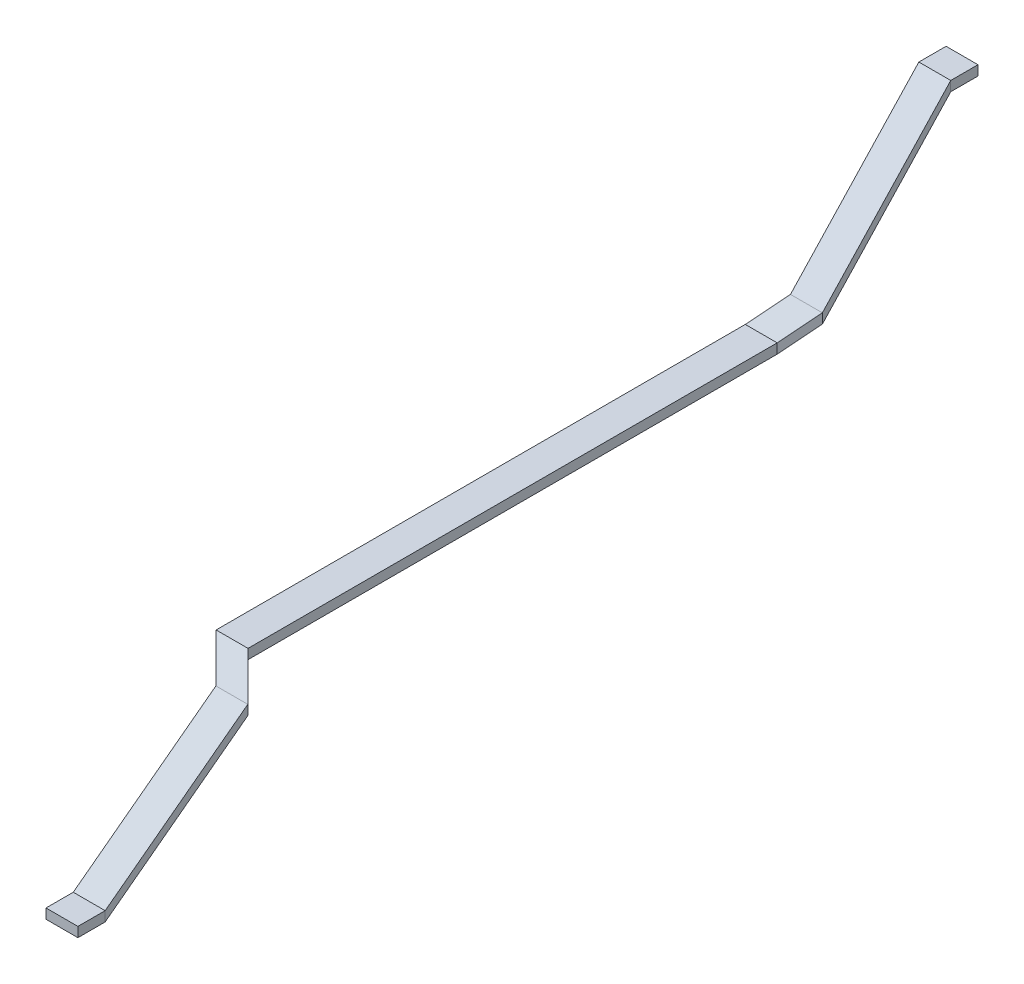
ISO-10303-21;
HEADER;
FILE_DESCRIPTION(('STEP AP214'),'2;1');
FILE_NAME('part.step','',(''),(''),'','','');
FILE_SCHEMA(('AUTOMOTIVE_DESIGN { 1 0 10303 214 1 1 1 1 }'));
ENDSEC;
DATA;
#1=APPLICATION_CONTEXT('core data for automotive mechanical design processes');
#2=APPLICATION_PROTOCOL_DEFINITION('international standard','automotive_design',2000,#1);
#3=PRODUCT_CONTEXT('',#1,'mechanical');
#4=PRODUCT('Part','Part','',(#3));
#5=PRODUCT_RELATED_PRODUCT_CATEGORY('part','',(#4));
#6=PRODUCT_DEFINITION_FORMATION('','',#4);
#7=PRODUCT_DEFINITION_CONTEXT('part definition',#1,'design');
#8=PRODUCT_DEFINITION('design','',#6,#7);
#9=PRODUCT_DEFINITION_SHAPE('','',#8);
#10=(LENGTH_UNIT() NAMED_UNIT(*) SI_UNIT(.MILLI.,.METRE.));
#11=(NAMED_UNIT(*) PLANE_ANGLE_UNIT() SI_UNIT($,.RADIAN.));
#12=(NAMED_UNIT(*) SI_UNIT($,.STERADIAN.) SOLID_ANGLE_UNIT());
#13=UNCERTAINTY_MEASURE_WITH_UNIT(LENGTH_MEASURE(1.E-05),#10,'distance_accuracy_value','');
#14=(GEOMETRIC_REPRESENTATION_CONTEXT(3) GLOBAL_UNCERTAINTY_ASSIGNED_CONTEXT((#13)) GLOBAL_UNIT_ASSIGNED_CONTEXT((#10,
#11,#12)) REPRESENTATION_CONTEXT('',''));
#15=CARTESIAN_POINT('',(0.,0.,0.));
#16=DIRECTION('',(0.,0.,1.));
#17=DIRECTION('',(1.,0.,0.));
#18=AXIS2_PLACEMENT_3D('',#15,#16,#17);
#19=CARTESIAN_POINT('',(0.,0.,-410.));
#20=DIRECTION('',(0.,0.,1.));
#21=DIRECTION('',(1.,0.,0.));
#22=AXIS2_PLACEMENT_3D('',#19,#20,#21);
#23=PLANE('',#22);
#24=DIRECTION('',(0.,-1.,0.));
#25=VECTOR('',#24,1.);
#26=CARTESIAN_POINT('',(3212.66029065679,352.155989281594,-410.));
#27=LINE('',#26,#25);
#28=CARTESIAN_POINT('',(3212.66029065679,352.155989281594,-410.));
#29=VERTEX_POINT('',#28);
#30=CARTESIAN_POINT('',(3212.66029065679,330.555989281594,-410.));
#31=VERTEX_POINT('',#30);
#32=EDGE_CURVE('E156',#29,#31,#27,.T.);
#33=ORIENTED_EDGE('',*,*,#32,.F.);
#34=DIRECTION('',(-1.,0.,0.));
#35=VECTOR('',#34,1.);
#36=CARTESIAN_POINT('',(3212.66029065679,352.155989281594,-410.));
#37=LINE('',#36,#35);
#38=CARTESIAN_POINT('',(3282.91029065679,352.155989281594,-410.));
#39=VERTEX_POINT('',#38);
#40=EDGE_CURVE('E42',#39,#29,#37,.T.);
#41=ORIENTED_EDGE('',*,*,#40,.F.);
#42=DIRECTION('',(0.,1.,0.));
#43=VECTOR('',#42,1.);
#44=CARTESIAN_POINT('',(3282.91029065679,352.155989281594,-410.));
#45=LINE('',#44,#43);
#46=CARTESIAN_POINT('',(3282.91029065679,330.555989281594,-410.));
#47=VERTEX_POINT('',#46);
#48=EDGE_CURVE('E144',#47,#39,#45,.T.);
#49=ORIENTED_EDGE('',*,*,#48,.F.);
#50=DIRECTION('',(1.,0.,0.));
#51=VECTOR('',#50,1.);
#52=CARTESIAN_POINT('',(3212.66029065679,330.555989281594,-410.));
#53=LINE('',#52,#51);
#54=EDGE_CURVE('E138',#31,#47,#53,.T.);
#55=ORIENTED_EDGE('',*,*,#54,.F.);
#56=EDGE_LOOP('',(#33,#41,#49,#55));
#57=FACE_BOUND('',#56,.T.);
#58=ADVANCED_FACE('F39',(#57),#23,.F.);
#59=CARTESIAN_POINT('',(3.39652809837698,-648.683155378033,1575.));
#60=DIRECTION('',(0.,0.,1.));
#61=DIRECTION('',(1.,0.,0.));
#62=AXIS2_PLACEMENT_3D('',#59,#60,#61);
#63=PLANE('',#62);
#64=DIRECTION('',(0.,-1.,0.));
#65=VECTOR('',#64,1.);
#66=CARTESIAN_POINT('',(3216.05681875516,-296.527166096439,1575.));
#67=LINE('',#66,#65);
#68=CARTESIAN_POINT('',(3216.05681875516,-296.527166096439,1575.));
#69=VERTEX_POINT('',#68);
#70=CARTESIAN_POINT('',(3216.05681875516,-318.127166096439,1575.));
#71=VERTEX_POINT('',#70);
#72=EDGE_CURVE('E292',#69,#71,#67,.T.);
#73=ORIENTED_EDGE('',*,*,#72,.T.);
#74=DIRECTION('',(1.,0.,0.));
#75=VECTOR('',#74,1.);
#76=CARTESIAN_POINT('',(3216.05681875516,-318.127166096439,1575.));
#77=LINE('',#76,#75);
#78=CARTESIAN_POINT('',(3286.30681875516,-318.127166096439,1575.));
#79=VERTEX_POINT('',#78);
#80=EDGE_CURVE('E332',#71,#79,#77,.T.);
#81=ORIENTED_EDGE('',*,*,#80,.T.);
#82=DIRECTION('',(0.,1.,0.));
#83=VECTOR('',#82,1.);
#84=CARTESIAN_POINT('',(3286.30681875516,-296.527166096439,1575.));
#85=LINE('',#84,#83);
#86=CARTESIAN_POINT('',(3286.30681875516,-296.527166096439,1575.));
#87=VERTEX_POINT('',#86);
#88=EDGE_CURVE('E322',#79,#87,#85,.T.);
#89=ORIENTED_EDGE('',*,*,#88,.T.);
#90=DIRECTION('',(-1.,0.,0.));
#91=VECTOR('',#90,1.);
#92=CARTESIAN_POINT('',(3216.05681875516,-296.527166096439,1575.));
#93=LINE('',#92,#91);
#94=EDGE_CURVE('E317',#87,#69,#93,.T.);
#95=ORIENTED_EDGE('',*,*,#94,.T.);
#96=EDGE_LOOP('',(#73,#81,#89,#95));
#97=FACE_BOUND('',#96,.T.);
#98=ADVANCED_FACE('F358',(#97),#63,.T.);
#99=CARTESIAN_POINT('',(3212.66029065679,352.155989281594,-350.));
#100=DIRECTION('',(1.,0.,0.));
#101=DIRECTION('',(0.,0.,-1.));
#102=AXIS2_PLACEMENT_3D('',#99,#100,#101);
#103=PLANE('',#102);
#104=DIRECTION('',(0.,0.,-1.));
#105=VECTOR('',#104,1.);
#106=CARTESIAN_POINT('',(3212.66029065679,330.555989281594,-350.));
#107=LINE('',#106,#105);
#108=CARTESIAN_POINT('',(3212.66029065679,330.555989281594,-350.));
#109=VERTEX_POINT('',#108);
#110=EDGE_CURVE('E171',#109,#31,#107,.T.);
#111=ORIENTED_EDGE('',*,*,#110,.F.);
#112=DIRECTION('',(0.,-1.,0.));
#113=VECTOR('',#112,1.);
#114=CARTESIAN_POINT('',(3212.66029065679,352.155989281594,-350.));
#115=LINE('',#114,#113);
#116=CARTESIAN_POINT('',(3212.66029065679,352.155989281594,-350.));
#117=VERTEX_POINT('',#116);
#118=EDGE_CURVE('E199',#117,#109,#115,.T.);
#119=ORIENTED_EDGE('',*,*,#118,.F.);
#120=DIRECTION('',(0.,0.,-1.));
#121=VECTOR('',#120,1.);
#122=CARTESIAN_POINT('',(3212.66029065679,352.155989281594,-350.));
#123=LINE('',#122,#121);
#124=EDGE_CURVE('E172',#117,#29,#123,.T.);
#125=ORIENTED_EDGE('',*,*,#124,.T.);
#126=ORIENTED_EDGE('',*,*,#32,.T.);
#127=EDGE_LOOP('',(#111,#119,#125,#126));
#128=FACE_BOUND('',#127,.T.);
#129=ADVANCED_FACE('F471',(#128),#103,.F.);
#130=CARTESIAN_POINT('',(3212.66029065679,330.555989281594,-350.));
#131=DIRECTION('',(0.,1.,0.));
#132=DIRECTION('',(0.,0.,1.));
#133=AXIS2_PLACEMENT_3D('',#130,#131,#132);
#134=PLANE('',#133);
#135=DIRECTION('',(0.,0.,-1.));
#136=VECTOR('',#135,1.);
#137=CARTESIAN_POINT('',(3282.91029065679,330.555989281594,-350.));
#138=LINE('',#137,#136);
#139=CARTESIAN_POINT('',(3282.91029065679,330.555989281594,-350.));
#140=VERTEX_POINT('',#139);
#141=EDGE_CURVE('E151',#140,#47,#138,.T.);
#142=ORIENTED_EDGE('',*,*,#141,.F.);
#143=DIRECTION('',(1.,0.,0.));
#144=VECTOR('',#143,1.);
#145=CARTESIAN_POINT('',(3212.66029065679,330.555989281594,-350.));
#146=LINE('',#145,#144);
#147=EDGE_CURVE('E192',#109,#140,#146,.T.);
#148=ORIENTED_EDGE('',*,*,#147,.F.);
#149=ORIENTED_EDGE('',*,*,#110,.T.);
#150=ORIENTED_EDGE('',*,*,#54,.T.);
#151=EDGE_LOOP('',(#142,#148,#149,#150));
#152=FACE_BOUND('',#151,.T.);
#153=ADVANCED_FACE('F474',(#152),#134,.F.);
#154=CARTESIAN_POINT('',(3282.91029065679,352.155989281594,-350.));
#155=DIRECTION('',(-1.,0.,0.));
#156=DIRECTION('',(0.,0.,1.));
#157=AXIS2_PLACEMENT_3D('',#154,#155,#156);
#158=PLANE('',#157);
#159=DIRECTION('',(0.,0.,-1.));
#160=VECTOR('',#159,1.);
#161=CARTESIAN_POINT('',(3282.91029065679,352.155989281594,-350.));
#162=LINE('',#161,#160);
#163=CARTESIAN_POINT('',(3282.91029065679,352.155989281594,-350.));
#164=VERTEX_POINT('',#163);
#165=EDGE_CURVE('E149',#164,#39,#162,.T.);
#166=ORIENTED_EDGE('',*,*,#165,.F.);
#167=DIRECTION('',(0.,1.,0.));
#168=VECTOR('',#167,1.);
#169=CARTESIAN_POINT('',(3282.91029065679,352.155989281594,-350.));
#170=LINE('',#169,#168);
#171=EDGE_CURVE('E185',#140,#164,#170,.T.);
#172=ORIENTED_EDGE('',*,*,#171,.F.);
#173=ORIENTED_EDGE('',*,*,#141,.T.);
#174=ORIENTED_EDGE('',*,*,#48,.T.);
#175=EDGE_LOOP('',(#166,#172,#173,#174));
#176=FACE_BOUND('',#175,.T.);
#177=ADVANCED_FACE('F146',(#176),#158,.F.);
#178=CARTESIAN_POINT('',(3212.66029065679,352.155989281594,-350.));
#179=DIRECTION('',(0.,-1.,0.));
#180=DIRECTION('',(0.,0.,-1.));
#181=AXIS2_PLACEMENT_3D('',#178,#179,#180);
#182=PLANE('',#181);
#183=ORIENTED_EDGE('',*,*,#40,.T.);
#184=ORIENTED_EDGE('',*,*,#124,.F.);
#185=DIRECTION('',(-1.,0.,0.));
#186=VECTOR('',#185,1.);
#187=CARTESIAN_POINT('',(3212.66029065679,352.155989281594,-350.));
#188=LINE('',#187,#186);
#189=EDGE_CURVE('E163',#164,#117,#188,.T.);
#190=ORIENTED_EDGE('',*,*,#189,.F.);
#191=ORIENTED_EDGE('',*,*,#165,.T.);
#192=EDGE_LOOP('',(#183,#184,#190,#191));
#193=FACE_BOUND('',#192,.T.);
#194=ADVANCED_FACE('F162',(#193),#182,.F.);
#195=CARTESIAN_POINT('',(3230.05262187985,67.7938873920759,-50.));
#196=DIRECTION('',(0.998323706682824,0.,-0.0578772552482072));
#197=DIRECTION('',(-0.0578772552482072,0.,-0.998323706682824));
#198=AXIS2_PLACEMENT_3D('',#195,#196,#197);
#199=PLANE('',#198);
#200=DIRECTION('',(-0.042038886652964,0.687329721152114,-0.725127979345671));
#201=VECTOR('',#200,1.);
#202=CARTESIAN_POINT('',(3230.05262187985,46.1938873920759,-50.));
#203=LINE('',#202,#201);
#204=CARTESIAN_POINT('',(3230.05262187985,46.1938873920759,-50.));
#205=VERTEX_POINT('',#204);
#206=EDGE_CURVE('E195',#205,#109,#203,.T.);
#207=ORIENTED_EDGE('',*,*,#206,.F.);
#208=DIRECTION('',(0.,-1.,0.));
#209=VECTOR('',#208,1.);
#210=CARTESIAN_POINT('',(3230.05262187985,67.7938873920759,-50.));
#211=LINE('',#210,#209);
#212=CARTESIAN_POINT('',(3230.05262187985,67.7938873920759,-50.));
#213=VERTEX_POINT('',#212);
#214=EDGE_CURVE('E227',#213,#205,#211,.T.);
#215=ORIENTED_EDGE('',*,*,#214,.F.);
#216=DIRECTION('',(-0.042038886652964,0.687329721152114,-0.725127979345671));
#217=VECTOR('',#216,1.);
#218=CARTESIAN_POINT('',(3230.05262187985,67.7938873920759,-50.));
#219=LINE('',#218,#217);
#220=EDGE_CURVE('E161',#213,#117,#219,.T.);
#221=ORIENTED_EDGE('',*,*,#220,.T.);
#222=ORIENTED_EDGE('',*,*,#118,.T.);
#223=EDGE_LOOP('',(#207,#215,#221,#222));
#224=FACE_BOUND('',#223,.T.);
#225=ADVANCED_FACE('F456',(#224),#199,.F.);
#226=CARTESIAN_POINT('',(3230.05262187985,46.1938873920759,-50.));
#227=DIRECTION('',(0.,0.725769577611728,0.68793787525713));
#228=DIRECTION('',(0.,-0.68793787525713,0.725769577611728));
#229=AXIS2_PLACEMENT_3D('',#226,#227,#228);
#230=PLANE('',#229);
#231=DIRECTION('',(-0.042038886652964,0.687329721152114,-0.725127979345671));
#232=VECTOR('',#231,1.);
#233=CARTESIAN_POINT('',(3300.30262187985,46.1938873920759,-50.));
#234=LINE('',#233,#232);
#235=CARTESIAN_POINT('',(3300.30262187985,46.1938873920759,-50.));
#236=VERTEX_POINT('',#235);
#237=EDGE_CURVE('E188',#236,#140,#234,.T.);
#238=ORIENTED_EDGE('',*,*,#237,.F.);
#239=DIRECTION('',(1.,0.,0.));
#240=VECTOR('',#239,1.);
#241=CARTESIAN_POINT('',(3230.05262187985,46.1938873920759,-50.));
#242=LINE('',#241,#240);
#243=EDGE_CURVE('E220',#205,#236,#242,.T.);
#244=ORIENTED_EDGE('',*,*,#243,.F.);
#245=ORIENTED_EDGE('',*,*,#206,.T.);
#246=ORIENTED_EDGE('',*,*,#147,.T.);
#247=EDGE_LOOP('',(#238,#244,#245,#246));
#248=FACE_BOUND('',#247,.T.);
#249=ADVANCED_FACE('F459',(#248),#230,.F.);
#250=CARTESIAN_POINT('',(3300.30262187985,67.7938873920759,-50.));
#251=DIRECTION('',(-0.998323706682824,0.,0.0578772552482072));
#252=DIRECTION('',(0.0578772552482072,0.,0.998323706682824));
#253=AXIS2_PLACEMENT_3D('',#250,#251,#252);
#254=PLANE('',#253);
#255=DIRECTION('',(-0.042038886652964,0.687329721152114,-0.725127979345671));
#256=VECTOR('',#255,1.);
#257=CARTESIAN_POINT('',(3300.30262187985,67.7938873920759,-50.));
#258=LINE('',#257,#256);
#259=CARTESIAN_POINT('',(3300.30262187985,67.7938873920759,-50.));
#260=VERTEX_POINT('',#259);
#261=EDGE_CURVE('E182',#260,#164,#258,.T.);
#262=ORIENTED_EDGE('',*,*,#261,.F.);
#263=DIRECTION('',(0.,1.,0.));
#264=VECTOR('',#263,1.);
#265=CARTESIAN_POINT('',(3300.30262187985,67.7938873920759,-50.));
#266=LINE('',#265,#264);
#267=EDGE_CURVE('E213',#236,#260,#266,.T.);
#268=ORIENTED_EDGE('',*,*,#267,.F.);
#269=ORIENTED_EDGE('',*,*,#237,.T.);
#270=ORIENTED_EDGE('',*,*,#171,.T.);
#271=EDGE_LOOP('',(#262,#268,#269,#270));
#272=FACE_BOUND('',#271,.T.);
#273=ADVANCED_FACE('F463',(#272),#254,.F.);
#274=CARTESIAN_POINT('',(3230.05262187985,67.7938873920759,-50.));
#275=DIRECTION('',(0.,-0.725769577611728,-0.68793787525713));
#276=DIRECTION('',(0.,0.68793787525713,-0.725769577611728));
#277=AXIS2_PLACEMENT_3D('',#274,#275,#276);
#278=PLANE('',#277);
#279=ORIENTED_EDGE('',*,*,#189,.T.);
#280=ORIENTED_EDGE('',*,*,#220,.F.);
#281=DIRECTION('',(-1.,0.,0.));
#282=VECTOR('',#281,1.);
#283=CARTESIAN_POINT('',(3230.05262187985,67.7938873920759,-50.));
#284=LINE('',#283,#282);
#285=EDGE_CURVE('E205',#260,#213,#284,.T.);
#286=ORIENTED_EDGE('',*,*,#285,.F.);
#287=ORIENTED_EDGE('',*,*,#261,.T.);
#288=EDGE_LOOP('',(#279,#280,#286,#287));
#289=FACE_BOUND('',#288,.T.);
#290=ADVANCED_FACE('F444',(#289),#278,.F.);
#291=CARTESIAN_POINT('',(3180.55,10.8,3.88578058618805E-13));
#292=DIRECTION('',(0.710632477772267,0.,0.703563416853981));
#293=DIRECTION('',(0.703563416853981,0.,-0.710632477772267));
#294=AXIS2_PLACEMENT_3D('',#291,#292,#293);
#295=PLANE('',#294);
#296=DIRECTION('',(0.546704586299471,0.62943776400192,-0.552197606448441));
#297=VECTOR('',#296,1.);
#298=CARTESIAN_POINT('',(3180.55,-10.7999999999999,3.88578058618805E-13));
#299=LINE('',#298,#297);
#300=CARTESIAN_POINT('',(3180.55,-10.7999999999999,4.16333634234434E-13));
#301=VERTEX_POINT('',#300);
#302=EDGE_CURVE('E223',#301,#205,#299,.T.);
#303=ORIENTED_EDGE('',*,*,#302,.F.);
#304=DIRECTION('',(0.,-1.,0.));
#305=VECTOR('',#304,1.);
#306=CARTESIAN_POINT('',(3180.55,10.8,3.88578058618805E-13));
#307=LINE('',#306,#305);
#308=CARTESIAN_POINT('',(3180.55,10.8,4.16333634234434E-13));
#309=VERTEX_POINT('',#308);
#310=EDGE_CURVE('E255',#309,#301,#307,.T.);
#311=ORIENTED_EDGE('',*,*,#310,.F.);
#312=DIRECTION('',(0.546704586299471,0.62943776400192,-0.552197606448441));
#313=VECTOR('',#312,1.);
#314=CARTESIAN_POINT('',(3180.55,10.8,3.88578058618805E-13));
#315=LINE('',#314,#313);
#316=EDGE_CURVE('E181',#309,#213,#315,.T.);
#317=ORIENTED_EDGE('',*,*,#316,.T.);
#318=ORIENTED_EDGE('',*,*,#214,.T.);
#319=EDGE_LOOP('',(#303,#311,#317,#318));
#320=FACE_BOUND('',#319,.T.);
#321=ADVANCED_FACE('F440',(#320),#295,.F.);
#322=CARTESIAN_POINT('',(3180.55,-10.7999999999999,3.88578058618805E-13));
#323=DIRECTION('',(0.,0.65947778508545,0.751724052414708));
#324=DIRECTION('',(0.,-0.751724052414708,0.65947778508545));
#325=AXIS2_PLACEMENT_3D('',#322,#323,#324);
#326=PLANE('',#325);
#327=DIRECTION('',(0.546704586299471,0.62943776400192,-0.552197606448441));
#328=VECTOR('',#327,1.);
#329=CARTESIAN_POINT('',(3250.8,-10.7999999999999,3.88578058618805E-13));
#330=LINE('',#329,#328);
#331=CARTESIAN_POINT('',(3250.8,-10.7999999999999,4.16333634234434E-13));
#332=VERTEX_POINT('',#331);
#333=EDGE_CURVE('E216',#332,#236,#330,.T.);
#334=ORIENTED_EDGE('',*,*,#333,.F.);
#335=DIRECTION('',(1.,0.,0.));
#336=VECTOR('',#335,1.);
#337=CARTESIAN_POINT('',(3180.55,-10.7999999999999,3.88578058618805E-13));
#338=LINE('',#337,#336);
#339=EDGE_CURVE('E248',#301,#332,#338,.T.);
#340=ORIENTED_EDGE('',*,*,#339,.F.);
#341=ORIENTED_EDGE('',*,*,#302,.T.);
#342=ORIENTED_EDGE('',*,*,#243,.T.);
#343=EDGE_LOOP('',(#334,#340,#341,#342));
#344=FACE_BOUND('',#343,.T.);
#345=ADVANCED_FACE('F443',(#344),#326,.F.);
#346=CARTESIAN_POINT('',(3250.8,10.8,3.88578058618805E-13));
#347=DIRECTION('',(-0.710632477772267,0.,-0.703563416853981));
#348=DIRECTION('',(-0.703563416853981,0.,0.710632477772267));
#349=AXIS2_PLACEMENT_3D('',#346,#347,#348);
#350=PLANE('',#349);
#351=DIRECTION('',(0.546704586299471,0.62943776400192,-0.552197606448441));
#352=VECTOR('',#351,1.);
#353=CARTESIAN_POINT('',(3250.8,10.8,3.88578058618805E-13));
#354=LINE('',#353,#352);
#355=CARTESIAN_POINT('',(3250.8,10.8,4.16333634234434E-13));
#356=VERTEX_POINT('',#355);
#357=EDGE_CURVE('E209',#356,#260,#354,.T.);
#358=ORIENTED_EDGE('',*,*,#357,.F.);
#359=DIRECTION('',(0.,1.,0.));
#360=VECTOR('',#359,1.);
#361=CARTESIAN_POINT('',(3250.8,10.8,3.88578058618805E-13));
#362=LINE('',#361,#360);
#363=EDGE_CURVE('E241',#332,#356,#362,.T.);
#364=ORIENTED_EDGE('',*,*,#363,.F.);
#365=ORIENTED_EDGE('',*,*,#333,.T.);
#366=ORIENTED_EDGE('',*,*,#267,.T.);
#367=EDGE_LOOP('',(#358,#364,#365,#366));
#368=FACE_BOUND('',#367,.T.);
#369=ADVANCED_FACE('F448',(#368),#350,.F.);
#370=CARTESIAN_POINT('',(3180.55,10.8,3.88578058618805E-13));
#371=DIRECTION('',(0.,-0.65947778508545,-0.751724052414708));
#372=DIRECTION('',(0.,0.751724052414708,-0.65947778508545));
#373=AXIS2_PLACEMENT_3D('',#370,#371,#372);
#374=PLANE('',#373);
#375=ORIENTED_EDGE('',*,*,#285,.T.);
#376=ORIENTED_EDGE('',*,*,#316,.F.);
#377=DIRECTION('',(-1.,0.,0.));
#378=VECTOR('',#377,1.);
#379=CARTESIAN_POINT('',(3180.55,10.8,3.88578058618805E-13));
#380=LINE('',#379,#378);
#381=EDGE_CURVE('E233',#356,#309,#380,.T.);
#382=ORIENTED_EDGE('',*,*,#381,.F.);
#383=ORIENTED_EDGE('',*,*,#357,.T.);
#384=EDGE_LOOP('',(#375,#376,#382,#383));
#385=FACE_BOUND('',#384,.T.);
#386=ADVANCED_FACE('F428',(#385),#374,.F.);
#387=CARTESIAN_POINT('',(3180.55,10.8,1165.));
#388=DIRECTION('',(1.,0.,0.));
#389=DIRECTION('',(0.,0.,-1.));
#390=AXIS2_PLACEMENT_3D('',#387,#388,#389);
#391=PLANE('',#390);
#392=DIRECTION('',(0.,0.,-1.));
#393=VECTOR('',#392,1.);
#394=CARTESIAN_POINT('',(3180.55,-10.7999999999999,1165.));
#395=LINE('',#394,#393);
#396=CARTESIAN_POINT('',(3180.55,-10.7999999999999,1165.));
#397=VERTEX_POINT('',#396);
#398=EDGE_CURVE('E251',#397,#301,#395,.T.);
#399=ORIENTED_EDGE('',*,*,#398,.F.);
#400=DIRECTION('',(0.,-1.,0.));
#401=VECTOR('',#400,1.);
#402=CARTESIAN_POINT('',(3180.55,10.8,1165.));
#403=LINE('',#402,#401);
#404=CARTESIAN_POINT('',(3180.55,10.8,1165.));
#405=VERTEX_POINT('',#404);
#406=EDGE_CURVE('E283',#405,#397,#403,.T.);
#407=ORIENTED_EDGE('',*,*,#406,.F.);
#408=DIRECTION('',(0.,0.,-1.));
#409=VECTOR('',#408,1.);
#410=CARTESIAN_POINT('',(3180.55,10.8,1165.));
#411=LINE('',#410,#409);
#412=EDGE_CURVE('E208',#405,#309,#411,.T.);
#413=ORIENTED_EDGE('',*,*,#412,.T.);
#414=ORIENTED_EDGE('',*,*,#310,.T.);
#415=EDGE_LOOP('',(#399,#407,#413,#414));
#416=FACE_BOUND('',#415,.T.);
#417=ADVANCED_FACE('F424',(#416),#391,.F.);
#418=CARTESIAN_POINT('',(3180.55,-10.7999999999999,1165.));
#419=DIRECTION('',(0.,1.,0.));
#420=DIRECTION('',(0.,0.,1.));
#421=AXIS2_PLACEMENT_3D('',#418,#419,#420);
#422=PLANE('',#421);
#423=DIRECTION('',(0.,0.,-1.));
#424=VECTOR('',#423,1.);
#425=CARTESIAN_POINT('',(3250.8,-10.7999999999999,1165.));
#426=LINE('',#425,#424);
#427=CARTESIAN_POINT('',(3250.8,-10.7999999999999,1165.));
#428=VERTEX_POINT('',#427);
#429=EDGE_CURVE('E244',#428,#332,#426,.T.);
#430=ORIENTED_EDGE('',*,*,#429,.F.);
#431=DIRECTION('',(1.,0.,0.));
#432=VECTOR('',#431,1.);
#433=CARTESIAN_POINT('',(3180.55,-10.7999999999999,1165.));
#434=LINE('',#433,#432);
#435=EDGE_CURVE('E276',#397,#428,#434,.T.);
#436=ORIENTED_EDGE('',*,*,#435,.F.);
#437=ORIENTED_EDGE('',*,*,#398,.T.);
#438=ORIENTED_EDGE('',*,*,#339,.T.);
#439=EDGE_LOOP('',(#430,#436,#437,#438));
#440=FACE_BOUND('',#439,.T.);
#441=ADVANCED_FACE('F427',(#440),#422,.F.);
#442=CARTESIAN_POINT('',(3250.8,10.8,1165.));
#443=DIRECTION('',(-1.,0.,0.));
#444=DIRECTION('',(0.,0.,1.));
#445=AXIS2_PLACEMENT_3D('',#442,#443,#444);
#446=PLANE('',#445);
#447=DIRECTION('',(0.,0.,-1.));
#448=VECTOR('',#447,1.);
#449=CARTESIAN_POINT('',(3250.8,10.8,1165.));
#450=LINE('',#449,#448);
#451=CARTESIAN_POINT('',(3250.8,10.8,1165.));
#452=VERTEX_POINT('',#451);
#453=EDGE_CURVE('E237',#452,#356,#450,.T.);
#454=ORIENTED_EDGE('',*,*,#453,.F.);
#455=DIRECTION('',(0.,1.,0.));
#456=VECTOR('',#455,1.);
#457=CARTESIAN_POINT('',(3250.8,10.8,1165.));
#458=LINE('',#457,#456);
#459=EDGE_CURVE('E269',#428,#452,#458,.T.);
#460=ORIENTED_EDGE('',*,*,#459,.F.);
#461=ORIENTED_EDGE('',*,*,#429,.T.);
#462=ORIENTED_EDGE('',*,*,#363,.T.);
#463=EDGE_LOOP('',(#454,#460,#461,#462));
#464=FACE_BOUND('',#463,.T.);
#465=ADVANCED_FACE('F432',(#464),#446,.F.);
#466=CARTESIAN_POINT('',(3180.55,10.8,1165.));
#467=DIRECTION('',(0.,-1.,0.));
#468=DIRECTION('',(0.,0.,-1.));
#469=AXIS2_PLACEMENT_3D('',#466,#467,#468);
#470=PLANE('',#469);
#471=ORIENTED_EDGE('',*,*,#381,.T.);
#472=ORIENTED_EDGE('',*,*,#412,.F.);
#473=DIRECTION('',(-1.,0.,0.));
#474=VECTOR('',#473,1.);
#475=CARTESIAN_POINT('',(3180.55,10.8,1165.));
#476=LINE('',#475,#474);
#477=EDGE_CURVE('E261',#452,#405,#476,.T.);
#478=ORIENTED_EDGE('',*,*,#477,.F.);
#479=ORIENTED_EDGE('',*,*,#453,.T.);
#480=EDGE_LOOP('',(#471,#472,#478,#479));
#481=FACE_BOUND('',#480,.T.);
#482=ADVANCED_FACE('F412',(#481),#470,.F.);
#483=CARTESIAN_POINT('',(3230.05262187985,-46.1938873920758,1215.));
#484=DIRECTION('',(0.710632477772261,0.,-0.703563416853987));
#485=DIRECTION('',(-0.703563416853987,0.,-0.710632477772261));
#486=AXIS2_PLACEMENT_3D('',#483,#484,#485);
#487=PLANE('',#486);
#488=DIRECTION('',(-0.546704586299474,0.629437764001923,-0.552197606448435));
#489=VECTOR('',#488,1.);
#490=CARTESIAN_POINT('',(3230.05262187985,-67.7938873920758,1215.));
#491=LINE('',#490,#489);
#492=CARTESIAN_POINT('',(3230.05262187985,-67.7938873920758,1215.));
#493=VERTEX_POINT('',#492);
#494=EDGE_CURVE('E279',#493,#397,#491,.T.);
#495=ORIENTED_EDGE('',*,*,#494,.F.);
#496=DIRECTION('',(0.,-1.,0.));
#497=VECTOR('',#496,1.);
#498=CARTESIAN_POINT('',(3230.05262187985,-46.1938873920758,1215.));
#499=LINE('',#498,#497);
#500=CARTESIAN_POINT('',(3230.05262187985,-46.1938873920758,1215.));
#501=VERTEX_POINT('',#500);
#502=EDGE_CURVE('E311',#501,#493,#499,.T.);
#503=ORIENTED_EDGE('',*,*,#502,.F.);
#504=DIRECTION('',(-0.546704586299474,0.629437764001923,-0.552197606448435));
#505=VECTOR('',#504,1.);
#506=CARTESIAN_POINT('',(3230.05262187985,-46.1938873920758,1215.));
#507=LINE('',#506,#505);
#508=EDGE_CURVE('E236',#501,#405,#507,.T.);
#509=ORIENTED_EDGE('',*,*,#508,.T.);
#510=ORIENTED_EDGE('',*,*,#406,.T.);
#511=EDGE_LOOP('',(#495,#503,#509,#510));
#512=FACE_BOUND('',#511,.T.);
#513=ADVANCED_FACE('F408',(#512),#487,.F.);
#514=CARTESIAN_POINT('',(3230.05262187985,-67.7938873920758,1215.));
#515=DIRECTION('',(0.,0.659477785085443,0.751724052414713));
#516=DIRECTION('',(0.,-0.751724052414713,0.659477785085443));
#517=AXIS2_PLACEMENT_3D('',#514,#515,#516);
#518=PLANE('',#517);
#519=DIRECTION('',(-0.546704586299474,0.629437764001923,-0.552197606448435));
#520=VECTOR('',#519,1.);
#521=CARTESIAN_POINT('',(3300.30262187985,-67.7938873920758,1215.));
#522=LINE('',#521,#520);
#523=CARTESIAN_POINT('',(3300.30262187985,-67.7938873920758,1215.));
#524=VERTEX_POINT('',#523);
#525=EDGE_CURVE('E272',#524,#428,#522,.T.);
#526=ORIENTED_EDGE('',*,*,#525,.F.);
#527=DIRECTION('',(1.,0.,0.));
#528=VECTOR('',#527,1.);
#529=CARTESIAN_POINT('',(3230.05262187985,-67.7938873920758,1215.));
#530=LINE('',#529,#528);
#531=EDGE_CURVE('E304',#493,#524,#530,.T.);
#532=ORIENTED_EDGE('',*,*,#531,.F.);
#533=ORIENTED_EDGE('',*,*,#494,.T.);
#534=ORIENTED_EDGE('',*,*,#435,.T.);
#535=EDGE_LOOP('',(#526,#532,#533,#534));
#536=FACE_BOUND('',#535,.T.);
#537=ADVANCED_FACE('F411',(#536),#518,.F.);
#538=CARTESIAN_POINT('',(3300.30262187985,-46.1938873920758,1215.));
#539=DIRECTION('',(-0.710632477772261,0.,0.703563416853987));
#540=DIRECTION('',(0.703563416853987,0.,0.710632477772261));
#541=AXIS2_PLACEMENT_3D('',#538,#539,#540);
#542=PLANE('',#541);
#543=DIRECTION('',(-0.546704586299474,0.629437764001923,-0.552197606448435));
#544=VECTOR('',#543,1.);
#545=CARTESIAN_POINT('',(3300.30262187985,-46.1938873920758,1215.));
#546=LINE('',#545,#544);
#547=CARTESIAN_POINT('',(3300.30262187985,-46.1938873920758,1215.));
#548=VERTEX_POINT('',#547);
#549=EDGE_CURVE('E265',#548,#452,#546,.T.);
#550=ORIENTED_EDGE('',*,*,#549,.F.);
#551=DIRECTION('',(0.,1.,0.));
#552=VECTOR('',#551,1.);
#553=CARTESIAN_POINT('',(3300.30262187985,-46.1938873920758,1215.));
#554=LINE('',#553,#552);
#555=EDGE_CURVE('E297',#524,#548,#554,.T.);
#556=ORIENTED_EDGE('',*,*,#555,.F.);
#557=ORIENTED_EDGE('',*,*,#525,.T.);
#558=ORIENTED_EDGE('',*,*,#459,.T.);
#559=EDGE_LOOP('',(#550,#556,#557,#558));
#560=FACE_BOUND('',#559,.T.);
#561=ADVANCED_FACE('F416',(#560),#542,.F.);
#562=CARTESIAN_POINT('',(3230.05262187985,-46.1938873920758,1215.));
#563=DIRECTION('',(0.,-0.659477785085443,-0.751724052414713));
#564=DIRECTION('',(0.,0.751724052414713,-0.659477785085443));
#565=AXIS2_PLACEMENT_3D('',#562,#563,#564);
#566=PLANE('',#565);
#567=ORIENTED_EDGE('',*,*,#477,.T.);
#568=ORIENTED_EDGE('',*,*,#508,.F.);
#569=DIRECTION('',(-1.,0.,0.));
#570=VECTOR('',#569,1.);
#571=CARTESIAN_POINT('',(3230.05262187985,-46.1938873920758,1215.));
#572=LINE('',#571,#570);
#573=EDGE_CURVE('E289',#548,#501,#572,.T.);
#574=ORIENTED_EDGE('',*,*,#573,.F.);
#575=ORIENTED_EDGE('',*,*,#549,.T.);
#576=EDGE_LOOP('',(#567,#568,#574,#575));
#577=FACE_BOUND('',#576,.T.);
#578=ADVANCED_FACE('F395',(#577),#566,.F.);
#579=CARTESIAN_POINT('',(3216.05681875516,-296.527166096439,1515.));
#580=DIRECTION('',(0.998913537031614,0.,0.0466019906762558));
#581=DIRECTION('',(0.0466019906762558,0.,-0.998913537031614));
#582=AXIS2_PLACEMENT_3D('',#579,#580,#581);
#583=PLANE('',#582);
#584=DIRECTION('',(0.0357970432885086,0.640277026941703,-0.767309520638507));
#585=VECTOR('',#584,1.);
#586=CARTESIAN_POINT('',(3216.05681875516,-318.127166096439,1515.));
#587=LINE('',#586,#585);
#588=CARTESIAN_POINT('',(3216.05681875516,-318.127166096439,1515.));
#589=VERTEX_POINT('',#588);
#590=EDGE_CURVE('E307',#589,#493,#587,.T.);
#591=ORIENTED_EDGE('',*,*,#590,.F.);
#592=DIRECTION('',(0.,-1.,0.));
#593=VECTOR('',#592,1.);
#594=CARTESIAN_POINT('',(3216.05681875516,-296.527166096439,1515.));
#595=LINE('',#594,#593);
#596=CARTESIAN_POINT('',(3216.05681875516,-296.527166096439,1515.));
#597=VERTEX_POINT('',#596);
#598=EDGE_CURVE('E345',#597,#589,#595,.T.);
#599=ORIENTED_EDGE('',*,*,#598,.F.);
#600=DIRECTION('',(0.0357970432885086,0.640277026941703,-0.767309520638507));
#601=VECTOR('',#600,1.);
#602=CARTESIAN_POINT('',(3216.05681875516,-296.527166096439,1515.));
#603=LINE('',#602,#601);
#604=EDGE_CURVE('E264',#597,#501,#603,.T.);
#605=ORIENTED_EDGE('',*,*,#604,.T.);
#606=ORIENTED_EDGE('',*,*,#502,.T.);
#607=EDGE_LOOP('',(#591,#599,#605,#606));
#608=FACE_BOUND('',#607,.T.);
#609=ADVANCED_FACE('F391',(#608),#583,.F.);
#610=CARTESIAN_POINT('',(3216.05681875516,-318.127166096439,1515.));
#611=DIRECTION('',(0.,0.767801619701744,0.640687656181528));
#612=DIRECTION('',(0.,-0.640687656181528,0.767801619701744));
#613=AXIS2_PLACEMENT_3D('',#610,#611,#612);
#614=PLANE('',#613);
#615=DIRECTION('',(0.0357970432885086,0.640277026941703,-0.767309520638507));
#616=VECTOR('',#615,1.);
#617=CARTESIAN_POINT('',(3286.30681875516,-318.127166096439,1515.));
#618=LINE('',#617,#616);
#619=CARTESIAN_POINT('',(3286.30681875516,-318.127166096439,1515.));
#620=VERTEX_POINT('',#619);
#621=EDGE_CURVE('E300',#620,#524,#618,.T.);
#622=ORIENTED_EDGE('',*,*,#621,.F.);
#623=DIRECTION('',(1.,0.,0.));
#624=VECTOR('',#623,1.);
#625=CARTESIAN_POINT('',(3216.05681875516,-318.127166096439,1515.));
#626=LINE('',#625,#624);
#627=EDGE_CURVE('E335',#589,#620,#626,.T.);
#628=ORIENTED_EDGE('',*,*,#627,.F.);
#629=ORIENTED_EDGE('',*,*,#590,.T.);
#630=ORIENTED_EDGE('',*,*,#531,.T.);
#631=EDGE_LOOP('',(#622,#628,#629,#630));
#632=FACE_BOUND('',#631,.T.);
#633=ADVANCED_FACE('F394',(#632),#614,.F.);
#634=CARTESIAN_POINT('',(3286.30681875516,-296.527166096439,1515.));
#635=DIRECTION('',(-0.998913537031614,0.,-0.0466019906762558));
#636=DIRECTION('',(-0.0466019906762558,0.,0.998913537031614));
#637=AXIS2_PLACEMENT_3D('',#634,#635,#636);
#638=PLANE('',#637);
#639=DIRECTION('',(0.0357970432885086,0.640277026941703,-0.767309520638507));
#640=VECTOR('',#639,1.);
#641=CARTESIAN_POINT('',(3286.30681875516,-296.527166096439,1515.));
#642=LINE('',#641,#640);
#643=CARTESIAN_POINT('',(3286.30681875516,-296.527166096439,1515.));
#644=VERTEX_POINT('',#643);
#645=EDGE_CURVE('E293',#644,#548,#642,.T.);
#646=ORIENTED_EDGE('',*,*,#645,.F.);
#647=DIRECTION('',(0.,1.,0.));
#648=VECTOR('',#647,1.);
#649=CARTESIAN_POINT('',(3286.30681875516,-296.527166096439,1515.));
#650=LINE('',#649,#648);
#651=EDGE_CURVE('E58',#620,#644,#650,.T.);
#652=ORIENTED_EDGE('',*,*,#651,.F.);
#653=ORIENTED_EDGE('',*,*,#621,.T.);
#654=ORIENTED_EDGE('',*,*,#555,.T.);
#655=EDGE_LOOP('',(#646,#652,#653,#654));
#656=FACE_BOUND('',#655,.T.);
#657=ADVANCED_FACE('F399',(#656),#638,.F.);
#658=CARTESIAN_POINT('',(3216.05681875516,-296.527166096439,1515.));
#659=DIRECTION('',(0.,-0.767801619701744,-0.640687656181528));
#660=DIRECTION('',(0.,0.640687656181528,-0.767801619701744));
#661=AXIS2_PLACEMENT_3D('',#658,#659,#660);
#662=PLANE('',#661);
#663=ORIENTED_EDGE('',*,*,#573,.T.);
#664=ORIENTED_EDGE('',*,*,#604,.F.);
#665=DIRECTION('',(-1.,0.,0.));
#666=VECTOR('',#665,1.);
#667=CARTESIAN_POINT('',(3216.05681875516,-296.527166096439,1515.));
#668=LINE('',#667,#666);
#669=EDGE_CURVE('E11',#644,#597,#668,.T.);
#670=ORIENTED_EDGE('',*,*,#669,.F.);
#671=ORIENTED_EDGE('',*,*,#645,.T.);
#672=EDGE_LOOP('',(#663,#664,#670,#671));
#673=FACE_BOUND('',#672,.T.);
#674=ADVANCED_FACE('F403',(#673),#662,.F.);
#675=CARTESIAN_POINT('',(3216.05681875516,-296.527166096439,1575.));
#676=DIRECTION('',(1.,0.,0.));
#677=DIRECTION('',(0.,0.,-1.));
#678=AXIS2_PLACEMENT_3D('',#675,#676,#677);
#679=PLANE('',#678);
#680=DIRECTION('',(0.,0.,-1.));
#681=VECTOR('',#680,1.);
#682=CARTESIAN_POINT('',(3216.05681875516,-318.127166096439,1575.));
#683=LINE('',#682,#681);
#684=EDGE_CURVE('E338',#71,#589,#683,.T.);
#685=ORIENTED_EDGE('',*,*,#684,.F.);
#686=ORIENTED_EDGE('',*,*,#72,.F.);
#687=DIRECTION('',(0.,0.,-1.));
#688=VECTOR('',#687,1.);
#689=CARTESIAN_POINT('',(3216.05681875516,-296.527166096439,1575.));
#690=LINE('',#689,#688);
#691=EDGE_CURVE('E321',#69,#597,#690,.T.);
#692=ORIENTED_EDGE('',*,*,#691,.T.);
#693=ORIENTED_EDGE('',*,*,#598,.T.);
#694=EDGE_LOOP('',(#685,#686,#692,#693));
#695=FACE_BOUND('',#694,.T.);
#696=ADVANCED_FACE('F366',(#695),#679,.F.);
#697=CARTESIAN_POINT('',(3216.05681875516,-318.127166096439,1575.));
#698=DIRECTION('',(0.,1.,0.));
#699=DIRECTION('',(0.,0.,1.));
#700=AXIS2_PLACEMENT_3D('',#697,#698,#699);
#701=PLANE('',#700);
#702=DIRECTION('',(0.,0.,-1.));
#703=VECTOR('',#702,1.);
#704=CARTESIAN_POINT('',(3286.30681875516,-318.127166096439,1575.));
#705=LINE('',#704,#703);
#706=EDGE_CURVE('E328',#79,#620,#705,.T.);
#707=ORIENTED_EDGE('',*,*,#706,.F.);
#708=ORIENTED_EDGE('',*,*,#80,.F.);
#709=ORIENTED_EDGE('',*,*,#684,.T.);
#710=ORIENTED_EDGE('',*,*,#627,.T.);
#711=EDGE_LOOP('',(#707,#708,#709,#710));
#712=FACE_BOUND('',#711,.T.);
#713=ADVANCED_FACE('F370',(#712),#701,.F.);
#714=CARTESIAN_POINT('',(3286.30681875516,-296.527166096439,1575.));
#715=DIRECTION('',(-1.,0.,0.));
#716=DIRECTION('',(0.,0.,1.));
#717=AXIS2_PLACEMENT_3D('',#714,#715,#716);
#718=PLANE('',#717);
#719=DIRECTION('',(0.,0.,-1.));
#720=VECTOR('',#719,1.);
#721=CARTESIAN_POINT('',(3286.30681875516,-296.527166096439,1575.));
#722=LINE('',#721,#720);
#723=EDGE_CURVE('E49',#87,#644,#722,.T.);
#724=ORIENTED_EDGE('',*,*,#723,.F.);
#725=ORIENTED_EDGE('',*,*,#88,.F.);
#726=ORIENTED_EDGE('',*,*,#706,.T.);
#727=ORIENTED_EDGE('',*,*,#651,.T.);
#728=EDGE_LOOP('',(#724,#725,#726,#727));
#729=FACE_BOUND('',#728,.T.);
#730=ADVANCED_FACE('F380',(#729),#718,.F.);
#731=CARTESIAN_POINT('',(3216.05681875516,-296.527166096439,1575.));
#732=DIRECTION('',(0.,-1.,0.));
#733=DIRECTION('',(0.,0.,-1.));
#734=AXIS2_PLACEMENT_3D('',#731,#732,#733);
#735=PLANE('',#734);
#736=ORIENTED_EDGE('',*,*,#669,.T.);
#737=ORIENTED_EDGE('',*,*,#691,.F.);
#738=ORIENTED_EDGE('',*,*,#94,.F.);
#739=ORIENTED_EDGE('',*,*,#723,.T.);
#740=EDGE_LOOP('',(#736,#737,#738,#739));
#741=FACE_BOUND('',#740,.T.);
#742=ADVANCED_FACE('F379',(#741),#735,.F.);
#743=CLOSED_SHELL('',(#58,#98,#129,#153,#177,#194,#225,#249,#273,#290,#321,#345,#369,#386,#417,
#441,#465,#482,#513,#537,#561,#578,#609,#633,#657,#674,#696,#713,#730,#742));
#744=MANIFOLD_SOLID_BREP('B2',#743);
#745=ADVANCED_BREP_SHAPE_REPRESENTATION('',(#18,#744),#14);
#746=SHAPE_DEFINITION_REPRESENTATION(#9,#745);
ENDSEC;
END-ISO-10303-21;
